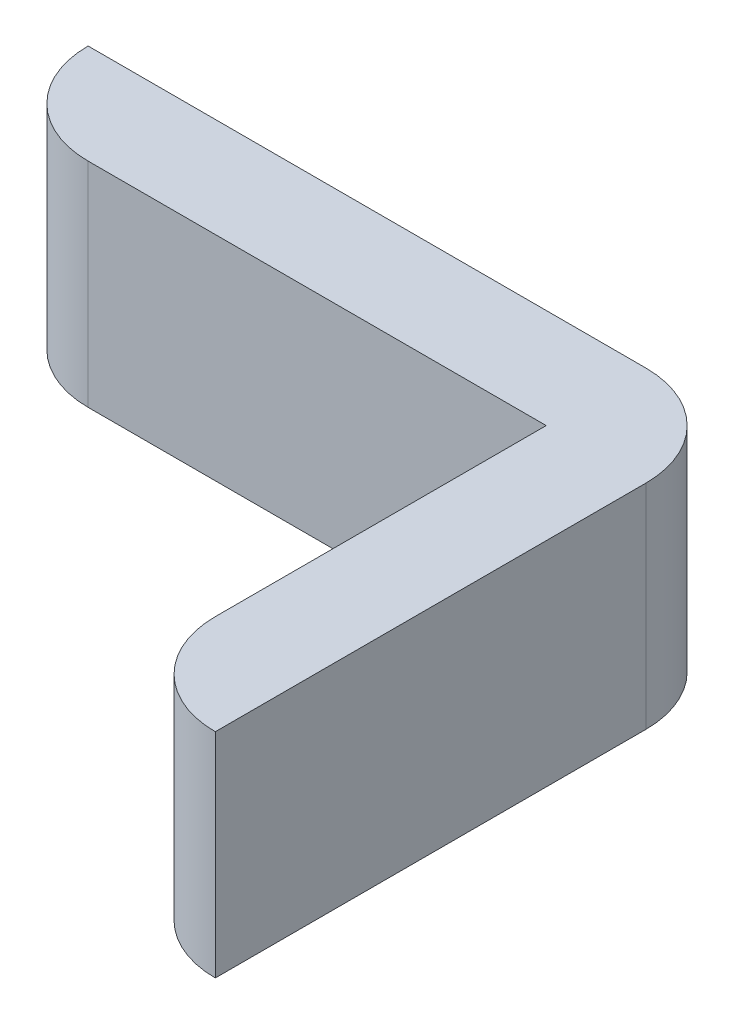
ISO-10303-21;
HEADER;
FILE_DESCRIPTION(('STEP AP214'),'2;1');
FILE_NAME('part.step','',(''),(''),'','','');
FILE_SCHEMA(('AUTOMOTIVE_DESIGN { 1 0 10303 214 1 1 1 1 }'));
ENDSEC;
DATA;
#1=APPLICATION_CONTEXT('core data for automotive mechanical design processes');
#2=APPLICATION_PROTOCOL_DEFINITION('international standard','automotive_design',2000,#1);
#3=PRODUCT_CONTEXT('',#1,'mechanical');
#4=PRODUCT('Part','Part','',(#3));
#5=PRODUCT_RELATED_PRODUCT_CATEGORY('part','',(#4));
#6=PRODUCT_DEFINITION_FORMATION('','',#4);
#7=PRODUCT_DEFINITION_CONTEXT('part definition',#1,'design');
#8=PRODUCT_DEFINITION('design','',#6,#7);
#9=PRODUCT_DEFINITION_SHAPE('','',#8);
#10=(LENGTH_UNIT() NAMED_UNIT(*) SI_UNIT(.MILLI.,.METRE.));
#11=(NAMED_UNIT(*) PLANE_ANGLE_UNIT() SI_UNIT($,.RADIAN.));
#12=(NAMED_UNIT(*) SI_UNIT($,.STERADIAN.) SOLID_ANGLE_UNIT());
#13=UNCERTAINTY_MEASURE_WITH_UNIT(LENGTH_MEASURE(1.E-05),#10,'distance_accuracy_value','');
#14=(GEOMETRIC_REPRESENTATION_CONTEXT(3) GLOBAL_UNCERTAINTY_ASSIGNED_CONTEXT((#13)) GLOBAL_UNIT_ASSIGNED_CONTEXT((#10,
#11,#12)) REPRESENTATION_CONTEXT('',''));
#15=CARTESIAN_POINT('',(0.,0.,0.));
#16=DIRECTION('',(0.,0.,1.));
#17=DIRECTION('',(1.,0.,0.));
#18=AXIS2_PLACEMENT_3D('',#15,#16,#17);
#19=CARTESIAN_POINT('',(4.1275,1.6375,1.33));
#20=DIRECTION('',(-1.,0.,0.));
#21=DIRECTION('',(0.,0.,1.));
#22=AXIS2_PLACEMENT_3D('',#19,#20,#21);
#23=PLANE('',#22);
#24=DIRECTION('',(0.,0.,-1.));
#25=VECTOR('',#24,1.);
#26=CARTESIAN_POINT('',(4.1275,1.6375,0.));
#27=LINE('',#26,#25);
#28=CARTESIAN_POINT('',(4.1275,1.6375,0.25));
#29=VERTEX_POINT('',#28);
#30=CARTESIAN_POINT('',(4.1275,1.6375,1.33));
#31=VERTEX_POINT('',#30);
#32=EDGE_CURVE('E129',#29,#31,#27,.F.);
#33=ORIENTED_EDGE('',*,*,#32,.F.);
#34=DIRECTION('',(0.,-1.,0.));
#35=VECTOR('',#34,1.);
#36=CARTESIAN_POINT('',(4.1275,1.6375,0.25));
#37=LINE('',#36,#35);
#38=CARTESIAN_POINT('',(4.1275,2.1725,0.25));
#39=VERTEX_POINT('',#38);
#40=EDGE_CURVE('E82',#39,#29,#37,.T.);
#41=ORIENTED_EDGE('',*,*,#40,.F.);
#42=DIRECTION('',(0.,0.,-1.));
#43=VECTOR('',#42,1.);
#44=CARTESIAN_POINT('',(4.1275,2.1725,0.));
#45=LINE('',#44,#43);
#46=CARTESIAN_POINT('',(4.1275,2.1725,1.33));
#47=VERTEX_POINT('',#46);
#48=EDGE_CURVE('E77',#39,#47,#45,.F.);
#49=ORIENTED_EDGE('',*,*,#48,.T.);
#50=DIRECTION('',(0.,-1.,0.));
#51=VECTOR('',#50,1.);
#52=CARTESIAN_POINT('',(4.1275,1.6375,1.33));
#53=LINE('',#52,#51);
#54=EDGE_CURVE('E123',#31,#47,#53,.F.);
#55=ORIENTED_EDGE('',*,*,#54,.F.);
#56=EDGE_LOOP('',(#33,#41,#49,#55));
#57=FACE_BOUND('',#56,.T.);
#58=ADVANCED_FACE('F17',(#57),#23,.F.);
#59=CARTESIAN_POINT('',(4.1275,1.6375,1.08));
#60=DIRECTION('',(0.,-1.,0.));
#61=DIRECTION('',(0.,0.,-1.));
#62=AXIS2_PLACEMENT_3D('',#59,#60,#61);
#63=CYLINDRICAL_SURFACE('',#62,0.25);
#64=CARTESIAN_POINT('',(4.1275,2.1725,1.08));
#65=DIRECTION('',(0.,-1.,0.));
#66=DIRECTION('',(0.,0.,-1.));
#67=AXIS2_PLACEMENT_3D('',#64,#65,#66);
#68=CIRCLE('',#67,0.25);
#69=CARTESIAN_POINT('',(3.8775,2.1725,1.08));
#70=VERTEX_POINT('',#69);
#71=EDGE_CURVE('E107',#47,#70,#68,.T.);
#72=ORIENTED_EDGE('',*,*,#71,.T.);
#73=DIRECTION('',(0.,1.,0.));
#74=VECTOR('',#73,1.);
#75=CARTESIAN_POINT('',(3.8775,1.6375,1.08));
#76=LINE('',#75,#74);
#77=CARTESIAN_POINT('',(3.8775,1.6375,1.08));
#78=VERTEX_POINT('',#77);
#79=EDGE_CURVE('E118',#70,#78,#76,.F.);
#80=ORIENTED_EDGE('',*,*,#79,.T.);
#81=CARTESIAN_POINT('',(4.1275,1.6375,1.08));
#82=DIRECTION('',(0.,-1.,0.));
#83=DIRECTION('',(0.,0.,-1.));
#84=AXIS2_PLACEMENT_3D('',#81,#82,#83);
#85=CIRCLE('',#84,0.25);
#86=EDGE_CURVE('E126',#31,#78,#85,.T.);
#87=ORIENTED_EDGE('',*,*,#86,.F.);
#88=ORIENTED_EDGE('',*,*,#54,.T.);
#89=EDGE_LOOP('',(#72,#80,#87,#88));
#90=FACE_BOUND('',#89,.T.);
#91=ADVANCED_FACE('F133',(#90),#63,.T.);
#92=CARTESIAN_POINT('',(3.8775,1.6375,0.25));
#93=DIRECTION('',(1.,0.,0.));
#94=DIRECTION('',(0.,0.,-1.));
#95=AXIS2_PLACEMENT_3D('',#92,#93,#94);
#96=PLANE('',#95);
#97=ORIENTED_EDGE('',*,*,#79,.F.);
#98=DIRECTION('',(0.,0.,-1.));
#99=VECTOR('',#98,1.);
#100=CARTESIAN_POINT('',(3.8775,2.1725,0.));
#101=LINE('',#100,#99);
#102=CARTESIAN_POINT('',(3.8775,2.1725,0.25));
#103=VERTEX_POINT('',#102);
#104=EDGE_CURVE('E102',#70,#103,#101,.T.);
#105=ORIENTED_EDGE('',*,*,#104,.T.);
#106=DIRECTION('',(0.,1.,0.));
#107=VECTOR('',#106,1.);
#108=CARTESIAN_POINT('',(3.8775,1.6375,0.25));
#109=LINE('',#108,#107);
#110=CARTESIAN_POINT('',(3.8775,1.6375,0.25));
#111=VERTEX_POINT('',#110);
#112=EDGE_CURVE('E115',#103,#111,#109,.F.);
#113=ORIENTED_EDGE('',*,*,#112,.T.);
#114=DIRECTION('',(0.,0.,-1.));
#115=VECTOR('',#114,1.);
#116=CARTESIAN_POINT('',(3.8775,1.6375,0.));
#117=LINE('',#116,#115);
#118=EDGE_CURVE('E128',#78,#111,#117,.T.);
#119=ORIENTED_EDGE('',*,*,#118,.F.);
#120=EDGE_LOOP('',(#97,#105,#113,#119));
#121=FACE_BOUND('',#120,.T.);
#122=ADVANCED_FACE('F158',(#121),#96,.F.);
#123=CARTESIAN_POINT('',(2.7285,1.6375,0.25));
#124=DIRECTION('',(0.,0.,-1.));
#125=DIRECTION('',(-1.,0.,0.));
#126=AXIS2_PLACEMENT_3D('',#123,#124,#125);
#127=PLANE('',#126);
#128=ORIENTED_EDGE('',*,*,#112,.F.);
#129=DIRECTION('',(1.,0.,0.));
#130=VECTOR('',#129,1.);
#131=CARTESIAN_POINT('',(2.4785,2.1725,0.25));
#132=LINE('',#131,#130);
#133=CARTESIAN_POINT('',(2.7285,2.1725,0.25));
#134=VERTEX_POINT('',#133);
#135=EDGE_CURVE('E98',#103,#134,#132,.F.);
#136=ORIENTED_EDGE('',*,*,#135,.T.);
#137=DIRECTION('',(0.,-1.,0.));
#138=VECTOR('',#137,1.);
#139=CARTESIAN_POINT('',(2.7285,1.6375,0.25));
#140=LINE('',#139,#138);
#141=CARTESIAN_POINT('',(2.7285,1.6375,0.25));
#142=VERTEX_POINT('',#141);
#143=EDGE_CURVE('E101',#142,#134,#140,.F.);
#144=ORIENTED_EDGE('',*,*,#143,.F.);
#145=DIRECTION('',(1.,0.,0.));
#146=VECTOR('',#145,1.);
#147=CARTESIAN_POINT('',(2.4785,1.6375,0.25));
#148=LINE('',#147,#146);
#149=EDGE_CURVE('E94',#111,#142,#148,.F.);
#150=ORIENTED_EDGE('',*,*,#149,.F.);
#151=EDGE_LOOP('',(#128,#136,#144,#150));
#152=FACE_BOUND('',#151,.T.);
#153=ADVANCED_FACE('F156',(#152),#127,.F.);
#154=CARTESIAN_POINT('',(3.8775,1.6375,0.25));
#155=DIRECTION('',(0.,-1.,0.));
#156=DIRECTION('',(0.,0.,-1.));
#157=AXIS2_PLACEMENT_3D('',#154,#155,#156);
#158=CYLINDRICAL_SURFACE('',#157,0.25);
#159=CARTESIAN_POINT('',(3.8775,2.1725,0.25));
#160=DIRECTION('',(0.,-1.,0.));
#161=DIRECTION('',(0.,0.,-1.));
#162=AXIS2_PLACEMENT_3D('',#159,#160,#161);
#163=CIRCLE('',#162,0.25);
#164=CARTESIAN_POINT('',(3.8775,2.1725,0.));
#165=VERTEX_POINT('',#164);
#166=EDGE_CURVE('E20',#165,#39,#163,.T.);
#167=ORIENTED_EDGE('',*,*,#166,.T.);
#168=ORIENTED_EDGE('',*,*,#40,.T.);
#169=CARTESIAN_POINT('',(3.8775,1.6375,0.25));
#170=DIRECTION('',(0.,-1.,0.));
#171=DIRECTION('',(0.,0.,-1.));
#172=AXIS2_PLACEMENT_3D('',#169,#170,#171);
#173=CIRCLE('',#172,0.25);
#174=CARTESIAN_POINT('',(3.8775,1.6375,0.));
#175=VERTEX_POINT('',#174);
#176=EDGE_CURVE('E92',#175,#29,#173,.T.);
#177=ORIENTED_EDGE('',*,*,#176,.F.);
#178=DIRECTION('',(0.,1.,0.));
#179=VECTOR('',#178,1.);
#180=CARTESIAN_POINT('',(3.8775,1.6375,0.));
#181=LINE('',#180,#179);
#182=EDGE_CURVE('E86',#175,#165,#181,.T.);
#183=ORIENTED_EDGE('',*,*,#182,.T.);
#184=EDGE_LOOP('',(#167,#168,#177,#183));
#185=FACE_BOUND('',#184,.T.);
#186=ADVANCED_FACE('F90',(#185),#158,.T.);
#187=CARTESIAN_POINT('',(2.4785,2.1725,0.));
#188=DIRECTION('',(0.,-1.,0.));
#189=DIRECTION('',(0.,0.,-1.));
#190=AXIS2_PLACEMENT_3D('',#187,#188,#189);
#191=PLANE('',#190);
#192=ORIENTED_EDGE('',*,*,#135,.F.);
#193=ORIENTED_EDGE('',*,*,#104,.F.);
#194=ORIENTED_EDGE('',*,*,#71,.F.);
#195=ORIENTED_EDGE('',*,*,#48,.F.);
#196=ORIENTED_EDGE('',*,*,#166,.F.);
#197=DIRECTION('',(1.,0.,0.));
#198=VECTOR('',#197,1.);
#199=CARTESIAN_POINT('',(3.8775,2.1725,0.));
#200=LINE('',#199,#198);
#201=CARTESIAN_POINT('',(2.4785,2.1725,0.));
#202=VERTEX_POINT('',#201);
#203=EDGE_CURVE('E74',#165,#202,#200,.F.);
#204=ORIENTED_EDGE('',*,*,#203,.T.);
#205=CARTESIAN_POINT('',(2.7285,2.1725,0.));
#206=DIRECTION('',(0.,-1.,0.));
#207=DIRECTION('',(0.,0.,-1.));
#208=AXIS2_PLACEMENT_3D('',#205,#206,#207);
#209=CIRCLE('',#208,0.25);
#210=EDGE_CURVE('E114',#134,#202,#209,.T.);
#211=ORIENTED_EDGE('',*,*,#210,.F.);
#212=EDGE_LOOP('',(#192,#193,#194,#195,#196,#204,#211));
#213=FACE_BOUND('',#212,.T.);
#214=ADVANCED_FACE('F72',(#213),#191,.F.);
#215=CARTESIAN_POINT('',(2.7285,1.6375,0.));
#216=DIRECTION('',(0.,-1.,0.));
#217=DIRECTION('',(0.,0.,-1.));
#218=AXIS2_PLACEMENT_3D('',#215,#216,#217);
#219=CYLINDRICAL_SURFACE('',#218,0.25);
#220=ORIENTED_EDGE('',*,*,#210,.T.);
#221=DIRECTION('',(0.,1.,0.));
#222=VECTOR('',#221,1.);
#223=CARTESIAN_POINT('',(2.4785,1.6375,0.));
#224=LINE('',#223,#222);
#225=CARTESIAN_POINT('',(2.4785,1.6375,0.));
#226=VERTEX_POINT('',#225);
#227=EDGE_CURVE('E26',#202,#226,#224,.F.);
#228=ORIENTED_EDGE('',*,*,#227,.T.);
#229=CARTESIAN_POINT('',(2.7285,1.6375,0.));
#230=DIRECTION('',(0.,-1.,0.));
#231=DIRECTION('',(0.,0.,-1.));
#232=AXIS2_PLACEMENT_3D('',#229,#230,#231);
#233=CIRCLE('',#232,0.25);
#234=EDGE_CURVE('E34',#142,#226,#233,.T.);
#235=ORIENTED_EDGE('',*,*,#234,.F.);
#236=ORIENTED_EDGE('',*,*,#143,.T.);
#237=EDGE_LOOP('',(#220,#228,#235,#236));
#238=FACE_BOUND('',#237,.T.);
#239=ADVANCED_FACE('F141',(#238),#219,.T.);
#240=CARTESIAN_POINT('',(2.4785,1.6375,0.));
#241=DIRECTION('',(0.,-1.,0.));
#242=DIRECTION('',(0.,0.,-1.));
#243=AXIS2_PLACEMENT_3D('',#240,#241,#242);
#244=PLANE('',#243);
#245=ORIENTED_EDGE('',*,*,#149,.T.);
#246=ORIENTED_EDGE('',*,*,#234,.T.);
#247=DIRECTION('',(1.,0.,0.));
#248=VECTOR('',#247,1.);
#249=CARTESIAN_POINT('',(3.8775,1.6375,0.));
#250=LINE('',#249,#248);
#251=EDGE_CURVE('E11',#226,#175,#250,.T.);
#252=ORIENTED_EDGE('',*,*,#251,.T.);
#253=ORIENTED_EDGE('',*,*,#176,.T.);
#254=ORIENTED_EDGE('',*,*,#32,.T.);
#255=ORIENTED_EDGE('',*,*,#86,.T.);
#256=ORIENTED_EDGE('',*,*,#118,.T.);
#257=EDGE_LOOP('',(#245,#246,#252,#253,#254,#255,#256));
#258=FACE_BOUND('',#257,.T.);
#259=ADVANCED_FACE('F139',(#258),#244,.T.);
#260=CARTESIAN_POINT('',(3.8775,1.6375,0.));
#261=DIRECTION('',(0.,0.,1.));
#262=DIRECTION('',(1.,0.,0.));
#263=AXIS2_PLACEMENT_3D('',#260,#261,#262);
#264=PLANE('',#263);
#265=ORIENTED_EDGE('',*,*,#227,.F.);
#266=ORIENTED_EDGE('',*,*,#203,.F.);
#267=ORIENTED_EDGE('',*,*,#182,.F.);
#268=ORIENTED_EDGE('',*,*,#251,.F.);
#269=EDGE_LOOP('',(#265,#266,#267,#268));
#270=FACE_BOUND('',#269,.T.);
#271=ADVANCED_FACE('F85',(#270),#264,.F.);
#272=CLOSED_SHELL('',(#58,#91,#122,#153,#186,#214,#239,#259,#271));
#273=MANIFOLD_SOLID_BREP('B1',#272);
#274=ADVANCED_BREP_SHAPE_REPRESENTATION('',(#18,#273),#14);
#275=SHAPE_DEFINITION_REPRESENTATION(#9,#274);
ENDSEC;
END-ISO-10303-21;
